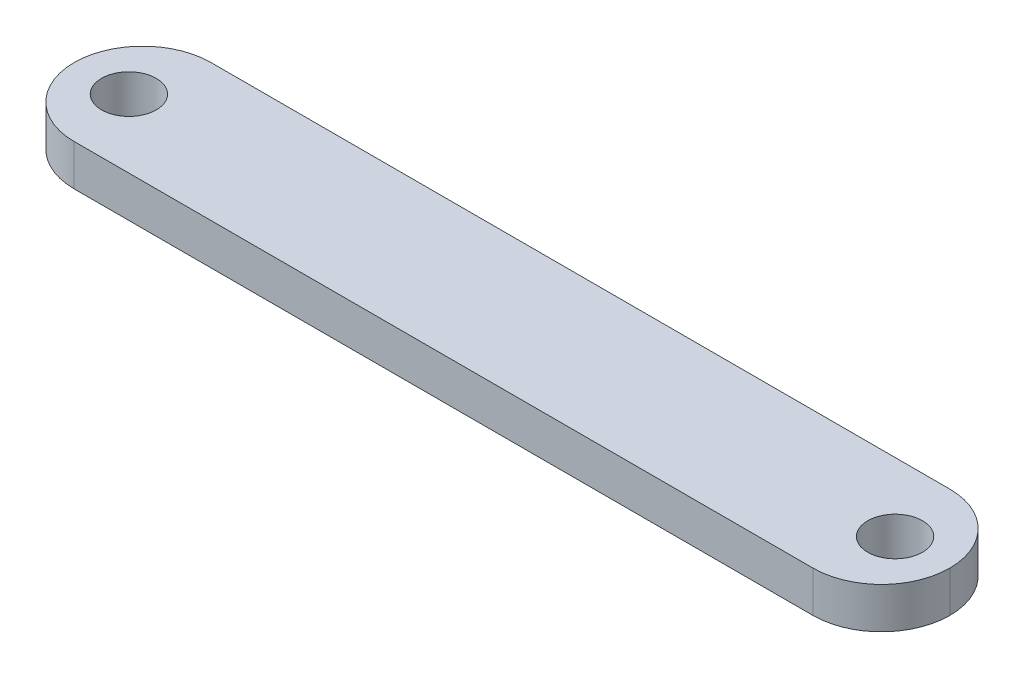
ISO-10303-21;
HEADER;
FILE_DESCRIPTION(('STEP AP214'),'2;1');
FILE_NAME('part.step','',(''),(''),'','','');
FILE_SCHEMA(('AUTOMOTIVE_DESIGN { 1 0 10303 214 1 1 1 1 }'));
ENDSEC;
DATA;
#1=APPLICATION_CONTEXT('core data for automotive mechanical design processes');
#2=APPLICATION_PROTOCOL_DEFINITION('international standard','automotive_design',2000,#1);
#3=PRODUCT_CONTEXT('',#1,'mechanical');
#4=PRODUCT('Part','Part','',(#3));
#5=PRODUCT_RELATED_PRODUCT_CATEGORY('part','',(#4));
#6=PRODUCT_DEFINITION_FORMATION('','',#4);
#7=PRODUCT_DEFINITION_CONTEXT('part definition',#1,'design');
#8=PRODUCT_DEFINITION('design','',#6,#7);
#9=PRODUCT_DEFINITION_SHAPE('','',#8);
#10=(LENGTH_UNIT() NAMED_UNIT(*) SI_UNIT(.MILLI.,.METRE.));
#11=(NAMED_UNIT(*) PLANE_ANGLE_UNIT() SI_UNIT($,.RADIAN.));
#12=(NAMED_UNIT(*) SI_UNIT($,.STERADIAN.) SOLID_ANGLE_UNIT());
#13=UNCERTAINTY_MEASURE_WITH_UNIT(LENGTH_MEASURE(1.E-05),#10,'distance_accuracy_value','');
#14=(GEOMETRIC_REPRESENTATION_CONTEXT(3) GLOBAL_UNCERTAINTY_ASSIGNED_CONTEXT((#13)) GLOBAL_UNIT_ASSIGNED_CONTEXT((#10,
#11,#12)) REPRESENTATION_CONTEXT('',''));
#15=CARTESIAN_POINT('',(0.,0.,0.));
#16=DIRECTION('',(0.,0.,1.));
#17=DIRECTION('',(1.,0.,0.));
#18=AXIS2_PLACEMENT_3D('',#15,#16,#17);
#19=CARTESIAN_POINT('',(0.,9.525,0.));
#20=DIRECTION('',(0.,-1.,0.));
#21=DIRECTION('',(0.,0.,-1.));
#22=AXIS2_PLACEMENT_3D('',#19,#20,#21);
#23=PLANE('',#22);
#24=CARTESIAN_POINT('',(187.325,9.525,-15.875));
#25=DIRECTION('',(0.,-1.,0.));
#26=DIRECTION('',(0.,0.,-1.));
#27=AXIS2_PLACEMENT_3D('',#24,#25,#26);
#28=CIRCLE('',#27,15.875);
#29=CARTESIAN_POINT('',(187.325,9.525,0.));
#30=VERTEX_POINT('',#29);
#31=CARTESIAN_POINT('',(203.2,9.525,-15.875));
#32=VERTEX_POINT('',#31);
#33=EDGE_CURVE('E53',#30,#32,#28,.F.);
#34=ORIENTED_EDGE('',*,*,#33,.T.);
#35=CARTESIAN_POINT('',(187.325,9.525,-15.875));
#36=DIRECTION('',(0.,-1.,0.));
#37=DIRECTION('',(0.,0.,-1.));
#38=AXIS2_PLACEMENT_3D('',#35,#36,#37);
#39=CIRCLE('',#38,15.875);
#40=CARTESIAN_POINT('',(187.325,9.525,-31.75));
#41=VERTEX_POINT('',#40);
#42=EDGE_CURVE('E135',#32,#41,#39,.F.);
#43=ORIENTED_EDGE('',*,*,#42,.T.);
#44=DIRECTION('',(-1.,0.,0.));
#45=VECTOR('',#44,1.);
#46=CARTESIAN_POINT('',(0.,9.525,-31.7499999999999));
#47=LINE('',#46,#45);
#48=CARTESIAN_POINT('',(15.875,9.525,-31.7499999999999));
#49=VERTEX_POINT('',#48);
#50=EDGE_CURVE('E111',#41,#49,#47,.T.);
#51=ORIENTED_EDGE('',*,*,#50,.T.);
#52=CARTESIAN_POINT('',(15.875,9.525,-15.8749999999999));
#53=DIRECTION('',(0.,-1.,0.));
#54=DIRECTION('',(0.,0.,-1.));
#55=AXIS2_PLACEMENT_3D('',#52,#53,#54);
#56=CIRCLE('',#55,15.875);
#57=CARTESIAN_POINT('',(0.,9.525,-15.875));
#58=VERTEX_POINT('',#57);
#59=EDGE_CURVE('E132',#49,#58,#56,.F.);
#60=ORIENTED_EDGE('',*,*,#59,.T.);
#61=CARTESIAN_POINT('',(15.875,9.525,-15.875));
#62=DIRECTION('',(0.,-1.,0.));
#63=DIRECTION('',(0.,0.,-1.));
#64=AXIS2_PLACEMENT_3D('',#61,#62,#63);
#65=CIRCLE('',#64,15.875);
#66=CARTESIAN_POINT('',(15.875,9.525,0.));
#67=VERTEX_POINT('',#66);
#68=EDGE_CURVE('E100',#58,#67,#65,.F.);
#69=ORIENTED_EDGE('',*,*,#68,.T.);
#70=DIRECTION('',(1.,0.,0.));
#71=VECTOR('',#70,1.);
#72=CARTESIAN_POINT('',(0.,9.525,0.));
#73=LINE('',#72,#71);
#74=EDGE_CURVE('E119',#67,#30,#73,.T.);
#75=ORIENTED_EDGE('',*,*,#74,.T.);
#76=EDGE_LOOP('',(#34,#43,#51,#60,#69,#75));
#77=FACE_BOUND('',#76,.T.);
#78=CARTESIAN_POINT('',(12.7,9.525,-15.875));
#79=DIRECTION('',(0.,1.,0.));
#80=DIRECTION('',(0.,0.,1.));
#81=AXIS2_PLACEMENT_3D('',#78,#79,#80);
#82=CIRCLE('',#81,6.35);
#83=CARTESIAN_POINT('',(12.7,9.525,-22.225));
#84=VERTEX_POINT('',#83);
#85=EDGE_CURVE('E123',#84,#84,#82,.T.);
#86=ORIENTED_EDGE('',*,*,#85,.F.);
#87=EDGE_LOOP('',(#86));
#88=FACE_BOUND('',#87,.T.);
#89=CARTESIAN_POINT('',(190.5,9.525,-15.875));
#90=DIRECTION('',(0.,1.,0.));
#91=DIRECTION('',(0.,0.,1.));
#92=AXIS2_PLACEMENT_3D('',#89,#90,#91);
#93=CIRCLE('',#92,6.35);
#94=CARTESIAN_POINT('',(190.5,9.525,-22.225));
#95=VERTEX_POINT('',#94);
#96=EDGE_CURVE('E139',#95,#95,#93,.T.);
#97=ORIENTED_EDGE('',*,*,#96,.F.);
#98=EDGE_LOOP('',(#97));
#99=FACE_BOUND('',#98,.T.);
#100=ADVANCED_FACE('F36',(#77,#88,#99),#23,.F.);
#101=CARTESIAN_POINT('',(0.,0.,0.));
#102=DIRECTION('',(0.,-1.,0.));
#103=DIRECTION('',(0.,0.,-1.));
#104=AXIS2_PLACEMENT_3D('',#101,#102,#103);
#105=PLANE('',#104);
#106=CARTESIAN_POINT('',(12.7,0.,-15.875));
#107=DIRECTION('',(0.,1.,0.));
#108=DIRECTION('',(0.,0.,1.));
#109=AXIS2_PLACEMENT_3D('',#106,#107,#108);
#110=CIRCLE('',#109,6.35);
#111=CARTESIAN_POINT('',(12.7,0.,-22.225));
#112=VERTEX_POINT('',#111);
#113=EDGE_CURVE('E155',#112,#112,#110,.T.);
#114=ORIENTED_EDGE('',*,*,#113,.T.);
#115=EDGE_LOOP('',(#114));
#116=FACE_BOUND('',#115,.T.);
#117=DIRECTION('',(-1.,0.,0.));
#118=VECTOR('',#117,1.);
#119=CARTESIAN_POINT('',(0.,0.,-31.7499999999999));
#120=LINE('',#119,#118);
#121=CARTESIAN_POINT('',(187.325,0.,-31.75));
#122=VERTEX_POINT('',#121);
#123=CARTESIAN_POINT('',(15.875,0.,-31.7499999999999));
#124=VERTEX_POINT('',#123);
#125=EDGE_CURVE('E108',#122,#124,#120,.T.);
#126=ORIENTED_EDGE('',*,*,#125,.F.);
#127=CARTESIAN_POINT('',(187.325,0.,-15.875));
#128=DIRECTION('',(0.,-1.,0.));
#129=DIRECTION('',(0.,0.,-1.));
#130=AXIS2_PLACEMENT_3D('',#127,#128,#129);
#131=CIRCLE('',#130,15.875);
#132=CARTESIAN_POINT('',(203.2,0.,-15.875));
#133=VERTEX_POINT('',#132);
#134=EDGE_CURVE('E91',#122,#133,#131,.T.);
#135=ORIENTED_EDGE('',*,*,#134,.T.);
#136=CARTESIAN_POINT('',(187.325,0.,-15.875));
#137=DIRECTION('',(0.,-1.,0.));
#138=DIRECTION('',(0.,0.,-1.));
#139=AXIS2_PLACEMENT_3D('',#136,#137,#138);
#140=CIRCLE('',#139,15.875);
#141=CARTESIAN_POINT('',(187.325,0.,0.));
#142=VERTEX_POINT('',#141);
#143=EDGE_CURVE('E101',#133,#142,#140,.T.);
#144=ORIENTED_EDGE('',*,*,#143,.T.);
#145=DIRECTION('',(1.,0.,0.));
#146=VECTOR('',#145,1.);
#147=CARTESIAN_POINT('',(0.,0.,0.));
#148=LINE('',#147,#146);
#149=CARTESIAN_POINT('',(15.875,0.,0.));
#150=VERTEX_POINT('',#149);
#151=EDGE_CURVE('E120',#150,#142,#148,.T.);
#152=ORIENTED_EDGE('',*,*,#151,.F.);
#153=CARTESIAN_POINT('',(15.875,0.,-15.875));
#154=DIRECTION('',(0.,-1.,0.));
#155=DIRECTION('',(0.,0.,-1.));
#156=AXIS2_PLACEMENT_3D('',#153,#154,#155);
#157=CIRCLE('',#156,15.875);
#158=CARTESIAN_POINT('',(0.,0.,-15.875));
#159=VERTEX_POINT('',#158);
#160=EDGE_CURVE('E112',#150,#159,#157,.T.);
#161=ORIENTED_EDGE('',*,*,#160,.T.);
#162=CARTESIAN_POINT('',(15.875,0.,-15.8749999999999));
#163=DIRECTION('',(0.,-1.,0.));
#164=DIRECTION('',(0.,0.,-1.));
#165=AXIS2_PLACEMENT_3D('',#162,#163,#164);
#166=CIRCLE('',#165,15.875);
#167=EDGE_CURVE('E118',#159,#124,#166,.T.);
#168=ORIENTED_EDGE('',*,*,#167,.T.);
#169=EDGE_LOOP('',(#126,#135,#144,#152,#161,#168));
#170=FACE_BOUND('',#169,.T.);
#171=CARTESIAN_POINT('',(190.5,0.,-15.875));
#172=DIRECTION('',(0.,1.,0.));
#173=DIRECTION('',(0.,0.,1.));
#174=AXIS2_PLACEMENT_3D('',#171,#172,#173);
#175=CIRCLE('',#174,6.35);
#176=CARTESIAN_POINT('',(190.5,0.,-22.225));
#177=VERTEX_POINT('',#176);
#178=EDGE_CURVE('E137',#177,#177,#175,.T.);
#179=ORIENTED_EDGE('',*,*,#178,.T.);
#180=EDGE_LOOP('',(#179));
#181=FACE_BOUND('',#180,.T.);
#182=ADVANCED_FACE('F115',(#116,#170,#181),#105,.T.);
#183=CARTESIAN_POINT('',(0.,9.525,0.));
#184=DIRECTION('',(0.,0.,-1.));
#185=DIRECTION('',(-1.,0.,0.));
#186=AXIS2_PLACEMENT_3D('',#183,#184,#185);
#187=PLANE('',#186);
#188=ORIENTED_EDGE('',*,*,#151,.T.);
#189=DIRECTION('',(0.,-1.,0.));
#190=VECTOR('',#189,1.);
#191=CARTESIAN_POINT('',(187.325,9.525,0.));
#192=LINE('',#191,#190);
#193=EDGE_CURVE('E11',#142,#30,#192,.F.);
#194=ORIENTED_EDGE('',*,*,#193,.T.);
#195=ORIENTED_EDGE('',*,*,#74,.F.);
#196=DIRECTION('',(0.,-1.,0.));
#197=VECTOR('',#196,1.);
#198=CARTESIAN_POINT('',(15.875,9.525,0.));
#199=LINE('',#198,#197);
#200=EDGE_CURVE('E45',#67,#150,#199,.T.);
#201=ORIENTED_EDGE('',*,*,#200,.T.);
#202=EDGE_LOOP('',(#188,#194,#195,#201));
#203=FACE_BOUND('',#202,.T.);
#204=ADVANCED_FACE('F150',(#203),#187,.F.);
#205=CARTESIAN_POINT('',(0.,9.525,-31.7499999999999));
#206=DIRECTION('',(0.,0.,1.));
#207=DIRECTION('',(1.,0.,0.));
#208=AXIS2_PLACEMENT_3D('',#205,#206,#207);
#209=PLANE('',#208);
#210=ORIENTED_EDGE('',*,*,#50,.F.);
#211=DIRECTION('',(0.,-1.,0.));
#212=VECTOR('',#211,1.);
#213=CARTESIAN_POINT('',(187.325,9.525,-31.75));
#214=LINE('',#213,#212);
#215=EDGE_CURVE('E95',#41,#122,#214,.T.);
#216=ORIENTED_EDGE('',*,*,#215,.T.);
#217=ORIENTED_EDGE('',*,*,#125,.T.);
#218=DIRECTION('',(0.,-1.,0.));
#219=VECTOR('',#218,1.);
#220=CARTESIAN_POINT('',(15.875,9.525,-31.7499999999999));
#221=LINE('',#220,#219);
#222=EDGE_CURVE('E113',#124,#49,#221,.F.);
#223=ORIENTED_EDGE('',*,*,#222,.T.);
#224=EDGE_LOOP('',(#210,#216,#217,#223));
#225=FACE_BOUND('',#224,.T.);
#226=ADVANCED_FACE('F106',(#225),#209,.F.);
#227=CARTESIAN_POINT('',(12.7,9.525,-15.875));
#228=DIRECTION('',(0.,-1.,0.));
#229=DIRECTION('',(0.,0.,-1.));
#230=AXIS2_PLACEMENT_3D('',#227,#228,#229);
#231=CYLINDRICAL_SURFACE('',#230,6.35);
#232=CARTESIAN_POINT('',(12.7,9.525,-22.225));
#233=CARTESIAN_POINT('',(12.7,9.42578125,-22.225));
#234=CARTESIAN_POINT('',(12.7,9.3265625,-22.225));
#235=CARTESIAN_POINT('',(12.7,9.128125,-22.225));
#236=CARTESIAN_POINT('',(12.7,9.02890625,-22.225));
#237=CARTESIAN_POINT('',(12.7,8.83046875,-22.225));
#238=CARTESIAN_POINT('',(12.7,8.73125,-22.225));
#239=CARTESIAN_POINT('',(12.7,8.5328125,-22.225));
#240=CARTESIAN_POINT('',(12.7,8.43359375,-22.225));
#241=CARTESIAN_POINT('',(12.7,8.23515625,-22.225));
#242=CARTESIAN_POINT('',(12.7,8.1359375,-22.225));
#243=CARTESIAN_POINT('',(12.7,7.9375,-22.225));
#244=CARTESIAN_POINT('',(12.7,7.83828125,-22.225));
#245=CARTESIAN_POINT('',(12.7,7.63984375,-22.225));
#246=CARTESIAN_POINT('',(12.7,7.540625,-22.225));
#247=CARTESIAN_POINT('',(12.7,7.3421875,-22.225));
#248=CARTESIAN_POINT('',(12.7,7.24296875,-22.225));
#249=CARTESIAN_POINT('',(12.7,7.04453125,-22.225));
#250=CARTESIAN_POINT('',(12.7,6.9453125,-22.225));
#251=CARTESIAN_POINT('',(12.7,6.746875,-22.225));
#252=CARTESIAN_POINT('',(12.7,6.64765625,-22.225));
#253=CARTESIAN_POINT('',(12.7,6.44921875,-22.225));
#254=CARTESIAN_POINT('',(12.7,6.35,-22.225));
#255=CARTESIAN_POINT('',(12.7,6.1515625,-22.225));
#256=CARTESIAN_POINT('',(12.7,6.05234375,-22.225));
#257=CARTESIAN_POINT('',(12.7,5.85390625,-22.225));
#258=CARTESIAN_POINT('',(12.7,5.7546875,-22.225));
#259=CARTESIAN_POINT('',(12.7,5.55625,-22.225));
#260=CARTESIAN_POINT('',(12.7,5.45703125,-22.225));
#261=CARTESIAN_POINT('',(12.7,5.25859375,-22.225));
#262=CARTESIAN_POINT('',(12.7,5.159375,-22.225));
#263=CARTESIAN_POINT('',(12.7,4.9609375,-22.225));
#264=CARTESIAN_POINT('',(12.7,4.86171875,-22.225));
#265=CARTESIAN_POINT('',(12.7,4.66328125,-22.225));
#266=CARTESIAN_POINT('',(12.7,4.5640625,-22.225));
#267=CARTESIAN_POINT('',(12.7,4.365625,-22.225));
#268=CARTESIAN_POINT('',(12.7,4.26640625,-22.225));
#269=CARTESIAN_POINT('',(12.7,4.06796875,-22.225));
#270=CARTESIAN_POINT('',(12.7,3.96875,-22.225));
#271=CARTESIAN_POINT('',(12.7,3.7703125,-22.225));
#272=CARTESIAN_POINT('',(12.7,3.67109375,-22.225));
#273=CARTESIAN_POINT('',(12.7,3.47265625,-22.225));
#274=CARTESIAN_POINT('',(12.7,3.3734375,-22.225));
#275=CARTESIAN_POINT('',(12.7,3.175,-22.225));
#276=CARTESIAN_POINT('',(12.7,3.07578125,-22.225));
#277=CARTESIAN_POINT('',(12.7,2.87734375,-22.225));
#278=CARTESIAN_POINT('',(12.7,2.778125,-22.225));
#279=CARTESIAN_POINT('',(12.7,2.5796875,-22.225));
#280=CARTESIAN_POINT('',(12.7,2.48046875,-22.225));
#281=CARTESIAN_POINT('',(12.7,2.28203125,-22.225));
#282=CARTESIAN_POINT('',(12.7,2.1828125,-22.225));
#283=CARTESIAN_POINT('',(12.7,1.984375,-22.225));
#284=CARTESIAN_POINT('',(12.7,1.88515625,-22.225));
#285=CARTESIAN_POINT('',(12.7,1.68671875,-22.225));
#286=CARTESIAN_POINT('',(12.7,1.5875,-22.225));
#287=CARTESIAN_POINT('',(12.7,1.3890625,-22.225));
#288=CARTESIAN_POINT('',(12.7,1.28984375,-22.225));
#289=CARTESIAN_POINT('',(12.7,1.09140625,-22.225));
#290=CARTESIAN_POINT('',(12.7,0.992187500000001,-22.225));
#291=CARTESIAN_POINT('',(12.7,0.793750000000001,-22.225));
#292=CARTESIAN_POINT('',(12.7,0.69453125,-22.225));
#293=CARTESIAN_POINT('',(12.7,0.49609375,-22.225));
#294=CARTESIAN_POINT('',(12.7,0.396875,-22.225));
#295=CARTESIAN_POINT('',(12.7,0.1984375,-22.225));
#296=CARTESIAN_POINT('',(12.7,0.0992187500000001,-22.225));
#297=CARTESIAN_POINT('',(12.7,0.,-22.225));
#298=B_SPLINE_CURVE_WITH_KNOTS('',3,(#232,#233,#234,#235,#236,#237,#238,#239,#240,#241,#242,
#243,#244,#245,#246,#247,#248,#249,#250,#251,#252,#253,#254,#255,#256,#257,#258,#259,#260,#261,
#262,#263,#264,#265,#266,#267,#268,#269,#270,#271,#272,#273,#274,#275,#276,#277,#278,#279,#280,
#281,#282,#283,#284,#285,#286,#287,#288,#289,#290,#291,#292,#293,#294,#295,#296,#297),
.UNSPECIFIED.,.F.,.F.,(4,2,2,2,2,2,2,2,2,2,2,2,2,2,2,2,2,2,2,2,2,2,2,2,2,2,2,2,2,2,2,2,4),(0.,
0.297656249999998,0.595312499999999,0.892968749999999,1.190625,1.48828125,1.7859375,2.08359375,
2.38125,2.67890625,2.9765625,3.27421875,3.571875,3.86953125,4.1671875,4.46484375,4.7625,
5.06015625,5.3578125,5.65546875,5.953125,6.25078125,6.5484375,6.84609375,7.14375,7.44140625,
7.7390625,8.03671875,8.334375,8.63203125,8.9296875,9.22734375,9.525),.UNSPECIFIED.);
#299=EDGE_CURVE('BSEAM174',#84,#112,#298,.T.);
#300=ORIENTED_EDGE('',*,*,#85,.T.);
#301=ORIENTED_EDGE('',*,*,#113,.F.);
#302=ORIENTED_EDGE('',*,*,#299,.T.);
#303=ORIENTED_EDGE('',*,*,#299,.F.);
#304=EDGE_LOOP('',(#300,#302,#301,#303));
#305=FACE_BOUND('',#304,.T.);
#306=ADVANCED_FACE('F174',(#305),#231,.F.);
#307=CARTESIAN_POINT('',(190.5,9.525,-15.875));
#308=DIRECTION('',(0.,-1.,0.));
#309=DIRECTION('',(0.,0.,-1.));
#310=AXIS2_PLACEMENT_3D('',#307,#308,#309);
#311=CYLINDRICAL_SURFACE('',#310,6.35);
#312=CARTESIAN_POINT('',(190.5,9.525,-22.225));
#313=CARTESIAN_POINT('',(190.5,9.42578125,-22.225));
#314=CARTESIAN_POINT('',(190.5,9.3265625,-22.225));
#315=CARTESIAN_POINT('',(190.5,9.128125,-22.225));
#316=CARTESIAN_POINT('',(190.5,9.02890625,-22.225));
#317=CARTESIAN_POINT('',(190.5,8.83046875,-22.225));
#318=CARTESIAN_POINT('',(190.5,8.73125,-22.225));
#319=CARTESIAN_POINT('',(190.5,8.5328125,-22.225));
#320=CARTESIAN_POINT('',(190.5,8.43359375,-22.225));
#321=CARTESIAN_POINT('',(190.5,8.23515625,-22.225));
#322=CARTESIAN_POINT('',(190.5,8.1359375,-22.225));
#323=CARTESIAN_POINT('',(190.5,7.9375,-22.225));
#324=CARTESIAN_POINT('',(190.5,7.83828125,-22.225));
#325=CARTESIAN_POINT('',(190.5,7.63984375,-22.225));
#326=CARTESIAN_POINT('',(190.5,7.540625,-22.225));
#327=CARTESIAN_POINT('',(190.5,7.3421875,-22.225));
#328=CARTESIAN_POINT('',(190.5,7.24296875,-22.225));
#329=CARTESIAN_POINT('',(190.5,7.04453125,-22.225));
#330=CARTESIAN_POINT('',(190.5,6.9453125,-22.225));
#331=CARTESIAN_POINT('',(190.5,6.746875,-22.225));
#332=CARTESIAN_POINT('',(190.5,6.64765625,-22.225));
#333=CARTESIAN_POINT('',(190.5,6.44921875,-22.225));
#334=CARTESIAN_POINT('',(190.5,6.35,-22.225));
#335=CARTESIAN_POINT('',(190.5,6.1515625,-22.225));
#336=CARTESIAN_POINT('',(190.5,6.05234375,-22.225));
#337=CARTESIAN_POINT('',(190.5,5.85390625,-22.225));
#338=CARTESIAN_POINT('',(190.5,5.7546875,-22.225));
#339=CARTESIAN_POINT('',(190.5,5.55625,-22.225));
#340=CARTESIAN_POINT('',(190.5,5.45703125,-22.225));
#341=CARTESIAN_POINT('',(190.5,5.25859375,-22.225));
#342=CARTESIAN_POINT('',(190.5,5.159375,-22.225));
#343=CARTESIAN_POINT('',(190.5,4.9609375,-22.225));
#344=CARTESIAN_POINT('',(190.5,4.86171875,-22.225));
#345=CARTESIAN_POINT('',(190.5,4.66328125,-22.225));
#346=CARTESIAN_POINT('',(190.5,4.5640625,-22.225));
#347=CARTESIAN_POINT('',(190.5,4.365625,-22.225));
#348=CARTESIAN_POINT('',(190.5,4.26640625,-22.225));
#349=CARTESIAN_POINT('',(190.5,4.06796875,-22.225));
#350=CARTESIAN_POINT('',(190.5,3.96875,-22.225));
#351=CARTESIAN_POINT('',(190.5,3.7703125,-22.225));
#352=CARTESIAN_POINT('',(190.5,3.67109375,-22.225));
#353=CARTESIAN_POINT('',(190.5,3.47265625,-22.225));
#354=CARTESIAN_POINT('',(190.5,3.3734375,-22.225));
#355=CARTESIAN_POINT('',(190.5,3.175,-22.225));
#356=CARTESIAN_POINT('',(190.5,3.07578125,-22.225));
#357=CARTESIAN_POINT('',(190.5,2.87734375,-22.225));
#358=CARTESIAN_POINT('',(190.5,2.778125,-22.225));
#359=CARTESIAN_POINT('',(190.5,2.5796875,-22.225));
#360=CARTESIAN_POINT('',(190.5,2.48046875,-22.225));
#361=CARTESIAN_POINT('',(190.5,2.28203125,-22.225));
#362=CARTESIAN_POINT('',(190.5,2.1828125,-22.225));
#363=CARTESIAN_POINT('',(190.5,1.984375,-22.225));
#364=CARTESIAN_POINT('',(190.5,1.88515625,-22.225));
#365=CARTESIAN_POINT('',(190.5,1.68671875,-22.225));
#366=CARTESIAN_POINT('',(190.5,1.5875,-22.225));
#367=CARTESIAN_POINT('',(190.5,1.3890625,-22.225));
#368=CARTESIAN_POINT('',(190.5,1.28984375,-22.225));
#369=CARTESIAN_POINT('',(190.5,1.09140625,-22.225));
#370=CARTESIAN_POINT('',(190.5,0.992187500000001,-22.225));
#371=CARTESIAN_POINT('',(190.5,0.793750000000001,-22.225));
#372=CARTESIAN_POINT('',(190.5,0.69453125,-22.225));
#373=CARTESIAN_POINT('',(190.5,0.49609375,-22.225));
#374=CARTESIAN_POINT('',(190.5,0.396875,-22.225));
#375=CARTESIAN_POINT('',(190.5,0.1984375,-22.225));
#376=CARTESIAN_POINT('',(190.5,0.0992187500000001,-22.225));
#377=CARTESIAN_POINT('',(190.5,0.,-22.225));
#378=B_SPLINE_CURVE_WITH_KNOTS('',3,(#312,#313,#314,#315,#316,#317,#318,#319,#320,#321,#322,
#323,#324,#325,#326,#327,#328,#329,#330,#331,#332,#333,#334,#335,#336,#337,#338,#339,#340,#341,
#342,#343,#344,#345,#346,#347,#348,#349,#350,#351,#352,#353,#354,#355,#356,#357,#358,#359,#360,
#361,#362,#363,#364,#365,#366,#367,#368,#369,#370,#371,#372,#373,#374,#375,#376,#377),
.UNSPECIFIED.,.F.,.F.,(4,2,2,2,2,2,2,2,2,2,2,2,2,2,2,2,2,2,2,2,2,2,2,2,2,2,2,2,2,2,2,2,4),(0.,
0.297656249999998,0.595312499999999,0.892968749999999,1.190625,1.48828125,1.7859375,2.08359375,
2.38125,2.67890625,2.9765625,3.27421875,3.571875,3.86953125,4.1671875,4.46484375,4.7625,
5.06015625,5.3578125,5.65546875,5.953125,6.25078125,6.5484375,6.84609375,7.14375,7.44140625,
7.7390625,8.03671875,8.334375,8.63203125,8.9296875,9.22734375,9.525),.UNSPECIFIED.);
#379=EDGE_CURVE('BSEAM163',#95,#177,#378,.T.);
#380=ORIENTED_EDGE('',*,*,#96,.T.);
#381=ORIENTED_EDGE('',*,*,#178,.F.);
#382=ORIENTED_EDGE('',*,*,#379,.T.);
#383=ORIENTED_EDGE('',*,*,#379,.F.);
#384=EDGE_LOOP('',(#380,#382,#381,#383));
#385=FACE_BOUND('',#384,.T.);
#386=ADVANCED_FACE('F163',(#385),#311,.F.);
#387=CARTESIAN_POINT('',(187.325,9.525,-15.875));
#388=DIRECTION('',(0.,-1.,0.));
#389=DIRECTION('',(0.,0.,-1.));
#390=AXIS2_PLACEMENT_3D('',#387,#388,#389);
#391=CYLINDRICAL_SURFACE('',#390,15.875);
#392=DIRECTION('',(0.,-1.,0.));
#393=VECTOR('',#392,1.);
#394=CARTESIAN_POINT('',(203.2,9.525,-15.875));
#395=LINE('',#394,#393);
#396=EDGE_CURVE('E96',#32,#133,#395,.T.);
#397=ORIENTED_EDGE('',*,*,#396,.F.);
#398=ORIENTED_EDGE('',*,*,#33,.F.);
#399=ORIENTED_EDGE('',*,*,#193,.F.);
#400=ORIENTED_EDGE('',*,*,#143,.F.);
#401=EDGE_LOOP('',(#397,#398,#399,#400));
#402=FACE_BOUND('',#401,.T.);
#403=ADVANCED_FACE('F153',(#402),#391,.T.);
#404=CARTESIAN_POINT('',(187.325,9.525,-15.875));
#405=DIRECTION('',(0.,-1.,0.));
#406=DIRECTION('',(0.,0.,-1.));
#407=AXIS2_PLACEMENT_3D('',#404,#405,#406);
#408=CYLINDRICAL_SURFACE('',#407,15.875);
#409=ORIENTED_EDGE('',*,*,#42,.F.);
#410=ORIENTED_EDGE('',*,*,#396,.T.);
#411=ORIENTED_EDGE('',*,*,#134,.F.);
#412=ORIENTED_EDGE('',*,*,#215,.F.);
#413=EDGE_LOOP('',(#409,#410,#411,#412));
#414=FACE_BOUND('',#413,.T.);
#415=ADVANCED_FACE('F94',(#414),#408,.T.);
#416=CARTESIAN_POINT('',(15.875,9.525,-15.875));
#417=DIRECTION('',(0.,-1.,0.));
#418=DIRECTION('',(0.,0.,-1.));
#419=AXIS2_PLACEMENT_3D('',#416,#417,#418);
#420=CYLINDRICAL_SURFACE('',#419,15.875);
#421=ORIENTED_EDGE('',*,*,#200,.F.);
#422=ORIENTED_EDGE('',*,*,#68,.F.);
#423=DIRECTION('',(0.,-1.,0.));
#424=VECTOR('',#423,1.);
#425=CARTESIAN_POINT('',(0.,9.525,-15.875));
#426=LINE('',#425,#424);
#427=EDGE_CURVE('E40',#159,#58,#426,.F.);
#428=ORIENTED_EDGE('',*,*,#427,.F.);
#429=ORIENTED_EDGE('',*,*,#160,.F.);
#430=EDGE_LOOP('',(#421,#422,#428,#429));
#431=FACE_BOUND('',#430,.T.);
#432=ADVANCED_FACE('F38',(#431),#420,.T.);
#433=CARTESIAN_POINT('',(15.875,9.525,-15.8749999999999));
#434=DIRECTION('',(0.,-1.,0.));
#435=DIRECTION('',(0.,0.,-1.));
#436=AXIS2_PLACEMENT_3D('',#433,#434,#435);
#437=CYLINDRICAL_SURFACE('',#436,15.875);
#438=ORIENTED_EDGE('',*,*,#59,.F.);
#439=ORIENTED_EDGE('',*,*,#222,.F.);
#440=ORIENTED_EDGE('',*,*,#167,.F.);
#441=ORIENTED_EDGE('',*,*,#427,.T.);
#442=EDGE_LOOP('',(#438,#439,#440,#441));
#443=FACE_BOUND('',#442,.T.);
#444=ADVANCED_FACE('F144',(#443),#437,.T.);
#445=CLOSED_SHELL('',(#100,#182,#204,#226,#306,#386,#403,#415,#432,#444));
#446=MANIFOLD_SOLID_BREP('B2',#445);
#447=ADVANCED_BREP_SHAPE_REPRESENTATION('',(#18,#446),#14);
#448=SHAPE_DEFINITION_REPRESENTATION(#9,#447);
ENDSEC;
END-ISO-10303-21;
